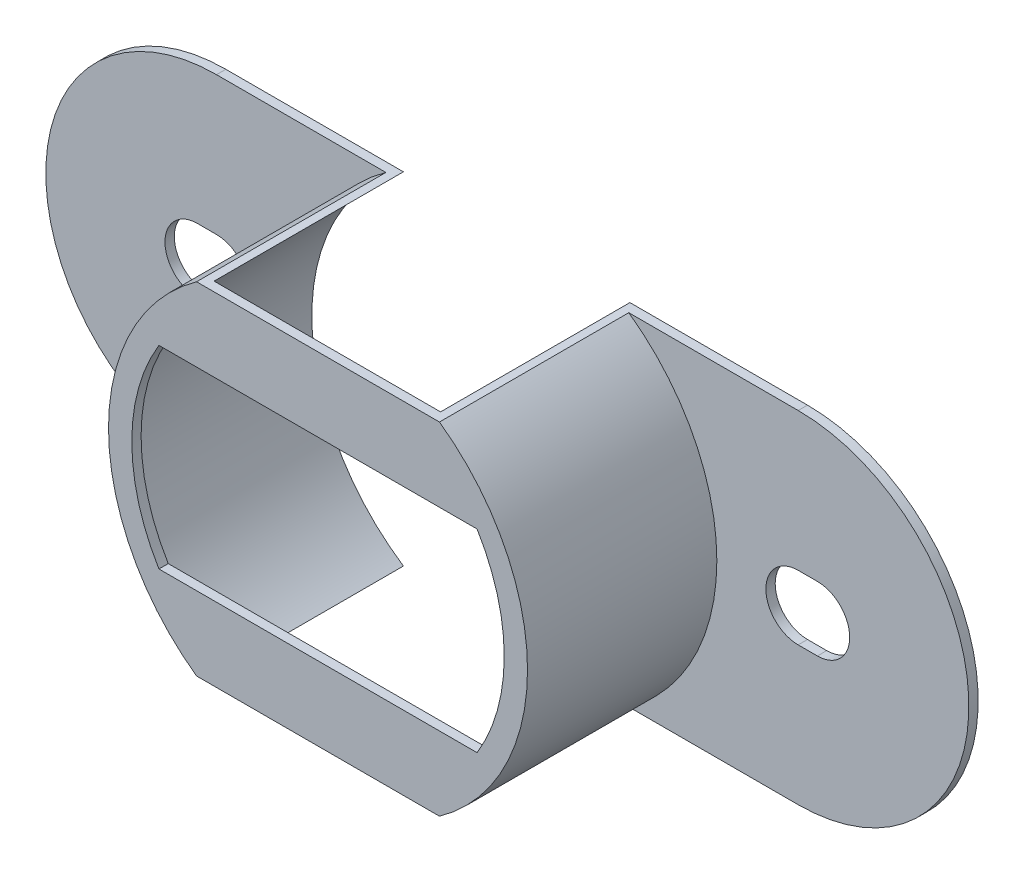
ISO-10303-21;
HEADER;
FILE_DESCRIPTION(('STEP AP214'),'2;1');
FILE_NAME('part.step','',(''),(''),'','','');
FILE_SCHEMA(('AUTOMOTIVE_DESIGN { 1 0 10303 214 1 1 1 1 }'));
ENDSEC;
DATA;
#1=APPLICATION_CONTEXT('core data for automotive mechanical design processes');
#2=APPLICATION_PROTOCOL_DEFINITION('international standard','automotive_design',2000,#1);
#3=PRODUCT_CONTEXT('',#1,'mechanical');
#4=PRODUCT('Part','Part','',(#3));
#5=PRODUCT_RELATED_PRODUCT_CATEGORY('part','',(#4));
#6=PRODUCT_DEFINITION_FORMATION('','',#4);
#7=PRODUCT_DEFINITION_CONTEXT('part definition',#1,'design');
#8=PRODUCT_DEFINITION('design','',#6,#7);
#9=PRODUCT_DEFINITION_SHAPE('','',#8);
#10=(LENGTH_UNIT() NAMED_UNIT(*) SI_UNIT(.MILLI.,.METRE.));
#11=(NAMED_UNIT(*) PLANE_ANGLE_UNIT() SI_UNIT($,.RADIAN.));
#12=(NAMED_UNIT(*) SI_UNIT($,.STERADIAN.) SOLID_ANGLE_UNIT());
#13=UNCERTAINTY_MEASURE_WITH_UNIT(LENGTH_MEASURE(1.E-05),#10,'distance_accuracy_value','');
#14=(GEOMETRIC_REPRESENTATION_CONTEXT(3) GLOBAL_UNCERTAINTY_ASSIGNED_CONTEXT((#13)) GLOBAL_UNIT_ASSIGNED_CONTEXT((#10,
#11,#12)) REPRESENTATION_CONTEXT('',''));
#15=CARTESIAN_POINT('',(0.,0.,0.));
#16=DIRECTION('',(0.,0.,1.));
#17=DIRECTION('',(1.,0.,0.));
#18=AXIS2_PLACEMENT_3D('',#15,#16,#17);
#19=CARTESIAN_POINT('',(-11.8999,0.,0.));
#20=DIRECTION('',(0.,0.,1.));
#21=DIRECTION('',(1.,0.,0.));
#22=AXIS2_PLACEMENT_3D('',#19,#20,#21);
#23=PLANE('',#22);
#24=CARTESIAN_POINT('',(12.6873,0.,0.));
#25=DIRECTION('',(0.,0.,1.));
#26=DIRECTION('',(1.,0.,0.));
#27=AXIS2_PLACEMENT_3D('',#24,#25,#26);
#28=CIRCLE('',#27,1.3208);
#29=CARTESIAN_POINT('',(12.6873,-1.3208,0.));
#30=VERTEX_POINT('',#29);
#31=CARTESIAN_POINT('',(12.6873,1.3208,0.));
#32=VERTEX_POINT('',#31);
#33=EDGE_CURVE('E357',#30,#32,#28,.T.);
#34=ORIENTED_EDGE('',*,*,#33,.T.);
#35=DIRECTION('',(-1.,0.,0.));
#36=VECTOR('',#35,1.);
#37=CARTESIAN_POINT('',(11.8999,1.3208,0.));
#38=LINE('',#37,#36);
#39=CARTESIAN_POINT('',(11.8999,1.3208,0.));
#40=VERTEX_POINT('',#39);
#41=EDGE_CURVE('E370',#32,#40,#38,.T.);
#42=ORIENTED_EDGE('',*,*,#41,.T.);
#43=CARTESIAN_POINT('',(11.8999,0.,0.));
#44=DIRECTION('',(0.,0.,1.));
#45=DIRECTION('',(1.,0.,0.));
#46=AXIS2_PLACEMENT_3D('',#43,#44,#45);
#47=CIRCLE('',#46,1.3208);
#48=CARTESIAN_POINT('',(11.8999,-1.3208,0.));
#49=VERTEX_POINT('',#48);
#50=EDGE_CURVE('E373',#40,#49,#47,.T.);
#51=ORIENTED_EDGE('',*,*,#50,.T.);
#52=DIRECTION('',(1.,0.,0.));
#53=VECTOR('',#52,1.);
#54=CARTESIAN_POINT('',(11.8999,-1.3208,0.));
#55=LINE('',#54,#53);
#56=EDGE_CURVE('E361',#49,#30,#55,.T.);
#57=ORIENTED_EDGE('',*,*,#56,.T.);
#58=EDGE_LOOP('',(#34,#42,#51,#57));
#59=FACE_BOUND('',#58,.T.);
#60=DIRECTION('',(1.,0.,0.));
#61=VECTOR('',#60,1.);
#62=CARTESIAN_POINT('',(-11.8999,-6.985,0.));
#63=LINE('',#62,#61);
#64=CARTESIAN_POINT('',(4.63332483212649,-6.985,0.));
#65=VERTEX_POINT('',#64);
#66=CARTESIAN_POINT('',(11.8999,-6.985,0.));
#67=VERTEX_POINT('',#66);
#68=EDGE_CURVE('E422',#65,#67,#63,.T.);
#69=ORIENTED_EDGE('',*,*,#68,.F.);
#70=CARTESIAN_POINT('',(0.,0.,0.));
#71=DIRECTION('',(0.,0.,-1.));
#72=DIRECTION('',(-1.,0.,0.));
#73=AXIS2_PLACEMENT_3D('',#70,#71,#72);
#74=CIRCLE('',#73,8.382);
#75=CARTESIAN_POINT('',(4.63332483212649,6.985,0.));
#76=VERTEX_POINT('',#75);
#77=EDGE_CURVE('E220',#76,#65,#74,.T.);
#78=ORIENTED_EDGE('',*,*,#77,.F.);
#79=DIRECTION('',(-1.,0.,0.));
#80=VECTOR('',#79,1.);
#81=CARTESIAN_POINT('',(-11.8999,6.985,0.));
#82=LINE('',#81,#80);
#83=CARTESIAN_POINT('',(11.8999,6.985,0.));
#84=VERTEX_POINT('',#83);
#85=EDGE_CURVE('E392',#84,#76,#82,.T.);
#86=ORIENTED_EDGE('',*,*,#85,.F.);
#87=CARTESIAN_POINT('',(11.8999,0.,0.));
#88=DIRECTION('',(0.,0.,1.));
#89=DIRECTION('',(1.,0.,0.));
#90=AXIS2_PLACEMENT_3D('',#87,#88,#89);
#91=CIRCLE('',#90,6.985);
#92=EDGE_CURVE('E417',#67,#84,#91,.T.);
#93=ORIENTED_EDGE('',*,*,#92,.F.);
#94=EDGE_LOOP('',(#69,#78,#86,#93));
#95=FACE_BOUND('',#94,.T.);
#96=ADVANCED_FACE('F34',(#59,#95),#23,.F.);
#97=CARTESIAN_POINT('',(-11.8999,0.,0.381));
#98=DIRECTION('',(0.,0.,1.));
#99=DIRECTION('',(1.,0.,0.));
#100=AXIS2_PLACEMENT_3D('',#97,#98,#99);
#101=PLANE('',#100);
#102=CARTESIAN_POINT('',(0.,0.,0.381));
#103=DIRECTION('',(0.,0.,1.));
#104=DIRECTION('',(1.,0.,0.));
#105=AXIS2_PLACEMENT_3D('',#102,#103,#104);
#106=CIRCLE('',#105,8.5725);
#107=CARTESIAN_POINT('',(-4.96966107999328,6.985,0.381));
#108=VERTEX_POINT('',#107);
#109=CARTESIAN_POINT('',(-4.96966107999328,-6.985,0.381));
#110=VERTEX_POINT('',#109);
#111=EDGE_CURVE('E240',#108,#110,#106,.T.);
#112=ORIENTED_EDGE('',*,*,#111,.F.);
#113=DIRECTION('',(-1.,0.,0.));
#114=VECTOR('',#113,1.);
#115=CARTESIAN_POINT('',(-11.8999,6.985,0.381));
#116=LINE('',#115,#114);
#117=CARTESIAN_POINT('',(-11.8999,6.985,0.381));
#118=VERTEX_POINT('',#117);
#119=EDGE_CURVE('E427',#108,#118,#116,.T.);
#120=ORIENTED_EDGE('',*,*,#119,.T.);
#121=CARTESIAN_POINT('',(-11.8999,0.,0.381));
#122=DIRECTION('',(0.,0.,1.));
#123=DIRECTION('',(1.,0.,0.));
#124=AXIS2_PLACEMENT_3D('',#121,#122,#123);
#125=CIRCLE('',#124,6.985);
#126=CARTESIAN_POINT('',(-11.8999,-6.985,0.381));
#127=VERTEX_POINT('',#126);
#128=EDGE_CURVE('E388',#118,#127,#125,.T.);
#129=ORIENTED_EDGE('',*,*,#128,.T.);
#130=DIRECTION('',(1.,0.,0.));
#131=VECTOR('',#130,1.);
#132=CARTESIAN_POINT('',(-11.8999,-6.985,0.381));
#133=LINE('',#132,#131);
#134=EDGE_CURVE('E401',#127,#110,#133,.T.);
#135=ORIENTED_EDGE('',*,*,#134,.T.);
#136=EDGE_LOOP('',(#112,#120,#129,#135));
#137=FACE_BOUND('',#136,.T.);
#138=DIRECTION('',(1.,0.,0.));
#139=VECTOR('',#138,1.);
#140=CARTESIAN_POINT('',(-12.6873,-1.3208,0.381));
#141=LINE('',#140,#139);
#142=CARTESIAN_POINT('',(-12.6873,-1.3208,0.381));
#143=VERTEX_POINT('',#142);
#144=CARTESIAN_POINT('',(-11.8999,-1.3208,0.381));
#145=VERTEX_POINT('',#144);
#146=EDGE_CURVE('E477',#143,#145,#141,.T.);
#147=ORIENTED_EDGE('',*,*,#146,.F.);
#148=CARTESIAN_POINT('',(-12.6873,0.,0.381));
#149=DIRECTION('',(0.,0.,1.));
#150=DIRECTION('',(1.,0.,0.));
#151=AXIS2_PLACEMENT_3D('',#148,#149,#150);
#152=CIRCLE('',#151,1.3208);
#153=CARTESIAN_POINT('',(-12.6873,1.3208,0.381));
#154=VERTEX_POINT('',#153);
#155=EDGE_CURVE('E348',#154,#143,#152,.T.);
#156=ORIENTED_EDGE('',*,*,#155,.F.);
#157=DIRECTION('',(-1.,0.,0.));
#158=VECTOR('',#157,1.);
#159=CARTESIAN_POINT('',(-12.6873,1.3208,0.381));
#160=LINE('',#159,#158);
#161=CARTESIAN_POINT('',(-11.8999,1.3208,0.381));
#162=VERTEX_POINT('',#161);
#163=EDGE_CURVE('E343',#162,#154,#160,.T.);
#164=ORIENTED_EDGE('',*,*,#163,.F.);
#165=CARTESIAN_POINT('',(-11.8999,0.,0.381));
#166=DIRECTION('',(0.,0.,1.));
#167=DIRECTION('',(1.,0.,0.));
#168=AXIS2_PLACEMENT_3D('',#165,#166,#167);
#169=CIRCLE('',#168,1.3208);
#170=EDGE_CURVE('E480',#145,#162,#169,.T.);
#171=ORIENTED_EDGE('',*,*,#170,.F.);
#172=EDGE_LOOP('',(#147,#156,#164,#171));
#173=FACE_BOUND('',#172,.T.);
#174=ADVANCED_FACE('F297',(#137,#173),#101,.T.);
#175=CARTESIAN_POINT('',(0.,0.,0.381));
#176=DIRECTION('',(0.,0.,1.));
#177=DIRECTION('',(1.,0.,0.));
#178=AXIS2_PLACEMENT_3D('',#175,#176,#177);
#179=CIRCLE('',#178,8.5725);
#180=CARTESIAN_POINT('',(4.96966107999329,-6.985,0.381));
#181=VERTEX_POINT('',#180);
#182=CARTESIAN_POINT('',(4.96966107999328,6.985,0.381));
#183=VERTEX_POINT('',#182);
#184=EDGE_CURVE('E252',#181,#183,#179,.T.);
#185=ORIENTED_EDGE('',*,*,#184,.F.);
#186=CARTESIAN_POINT('',(11.8999,-6.985,0.381));
#187=VERTEX_POINT('',#186);
#188=EDGE_CURVE('E391',#181,#187,#133,.T.);
#189=ORIENTED_EDGE('',*,*,#188,.T.);
#190=CARTESIAN_POINT('',(11.8999,0.,0.381));
#191=DIRECTION('',(0.,0.,1.));
#192=DIRECTION('',(1.,0.,0.));
#193=AXIS2_PLACEMENT_3D('',#190,#191,#192);
#194=CIRCLE('',#193,6.985);
#195=CARTESIAN_POINT('',(11.8999,6.985,0.381));
#196=VERTEX_POINT('',#195);
#197=EDGE_CURVE('E395',#187,#196,#194,.T.);
#198=ORIENTED_EDGE('',*,*,#197,.T.);
#199=EDGE_CURVE('E414',#196,#183,#116,.T.);
#200=ORIENTED_EDGE('',*,*,#199,.T.);
#201=EDGE_LOOP('',(#185,#189,#198,#200));
#202=FACE_BOUND('',#201,.T.);
#203=DIRECTION('',(-1.,0.,0.));
#204=VECTOR('',#203,1.);
#205=CARTESIAN_POINT('',(11.8999,1.3208,0.381));
#206=LINE('',#205,#204);
#207=CARTESIAN_POINT('',(12.6873,1.3208,0.381));
#208=VERTEX_POINT('',#207);
#209=CARTESIAN_POINT('',(11.8999,1.3208,0.381));
#210=VERTEX_POINT('',#209);
#211=EDGE_CURVE('E360',#208,#210,#206,.T.);
#212=ORIENTED_EDGE('',*,*,#211,.F.);
#213=CARTESIAN_POINT('',(12.6873,0.,0.381));
#214=DIRECTION('',(0.,0.,1.));
#215=DIRECTION('',(1.,0.,0.));
#216=AXIS2_PLACEMENT_3D('',#213,#214,#215);
#217=CIRCLE('',#216,1.3208);
#218=CARTESIAN_POINT('',(12.6873,-1.3208,0.381));
#219=VERTEX_POINT('',#218);
#220=EDGE_CURVE('E358',#219,#208,#217,.T.);
#221=ORIENTED_EDGE('',*,*,#220,.F.);
#222=DIRECTION('',(1.,0.,0.));
#223=VECTOR('',#222,1.);
#224=CARTESIAN_POINT('',(11.8999,-1.3208,0.381));
#225=LINE('',#224,#223);
#226=CARTESIAN_POINT('',(11.8999,-1.3208,0.381));
#227=VERTEX_POINT('',#226);
#228=EDGE_CURVE('E366',#227,#219,#225,.T.);
#229=ORIENTED_EDGE('',*,*,#228,.F.);
#230=CARTESIAN_POINT('',(11.8999,0.,0.381));
#231=DIRECTION('',(0.,0.,1.));
#232=DIRECTION('',(1.,0.,0.));
#233=AXIS2_PLACEMENT_3D('',#230,#231,#232);
#234=CIRCLE('',#233,1.3208);
#235=EDGE_CURVE('E363',#210,#227,#234,.T.);
#236=ORIENTED_EDGE('',*,*,#235,.F.);
#237=EDGE_LOOP('',(#212,#221,#229,#236));
#238=FACE_BOUND('',#237,.T.);
#239=ADVANCED_FACE('F304',(#202,#238),#101,.T.);
#240=CARTESIAN_POINT('',(-4.63332483212649,6.985,0.));
#241=VERTEX_POINT('',#240);
#242=CARTESIAN_POINT('',(-11.8999,6.985,0.));
#243=VERTEX_POINT('',#242);
#244=EDGE_CURVE('E323',#241,#243,#82,.T.);
#245=ORIENTED_EDGE('',*,*,#244,.F.);
#246=CARTESIAN_POINT('',(0.,0.,0.));
#247=DIRECTION('',(0.,0.,-1.));
#248=DIRECTION('',(-1.,0.,0.));
#249=AXIS2_PLACEMENT_3D('',#246,#247,#248);
#250=CIRCLE('',#249,8.382);
#251=CARTESIAN_POINT('',(-4.63332483212649,-6.985,0.));
#252=VERTEX_POINT('',#251);
#253=EDGE_CURVE('E227',#252,#241,#250,.T.);
#254=ORIENTED_EDGE('',*,*,#253,.F.);
#255=CARTESIAN_POINT('',(-11.8999,-6.985,0.));
#256=VERTEX_POINT('',#255);
#257=EDGE_CURVE('E419',#256,#252,#63,.T.);
#258=ORIENTED_EDGE('',*,*,#257,.F.);
#259=CARTESIAN_POINT('',(-11.8999,0.,0.));
#260=DIRECTION('',(0.,0.,1.));
#261=DIRECTION('',(1.,0.,0.));
#262=AXIS2_PLACEMENT_3D('',#259,#260,#261);
#263=CIRCLE('',#262,6.985);
#264=EDGE_CURVE('E387',#243,#256,#263,.T.);
#265=ORIENTED_EDGE('',*,*,#264,.F.);
#266=EDGE_LOOP('',(#245,#254,#258,#265));
#267=FACE_BOUND('',#266,.T.);
#268=CARTESIAN_POINT('',(-12.6873,0.,0.));
#269=DIRECTION('',(0.,0.,1.));
#270=DIRECTION('',(1.,0.,0.));
#271=AXIS2_PLACEMENT_3D('',#268,#269,#270);
#272=CIRCLE('',#271,1.3208);
#273=CARTESIAN_POINT('',(-12.6873,1.3208,0.));
#274=VERTEX_POINT('',#273);
#275=CARTESIAN_POINT('',(-12.6873,-1.3208,0.));
#276=VERTEX_POINT('',#275);
#277=EDGE_CURVE('E327',#274,#276,#272,.T.);
#278=ORIENTED_EDGE('',*,*,#277,.T.);
#279=DIRECTION('',(1.,0.,0.));
#280=VECTOR('',#279,1.);
#281=CARTESIAN_POINT('',(-12.6873,-1.3208,0.));
#282=LINE('',#281,#280);
#283=CARTESIAN_POINT('',(-11.8999,-1.3208,0.));
#284=VERTEX_POINT('',#283);
#285=EDGE_CURVE('E329',#276,#284,#282,.T.);
#286=ORIENTED_EDGE('',*,*,#285,.T.);
#287=CARTESIAN_POINT('',(-11.8999,0.,0.));
#288=DIRECTION('',(0.,0.,1.));
#289=DIRECTION('',(1.,0.,0.));
#290=AXIS2_PLACEMENT_3D('',#287,#288,#289);
#291=CIRCLE('',#290,1.3208);
#292=CARTESIAN_POINT('',(-11.8999,1.3208,0.));
#293=VERTEX_POINT('',#292);
#294=EDGE_CURVE('E338',#284,#293,#291,.T.);
#295=ORIENTED_EDGE('',*,*,#294,.T.);
#296=DIRECTION('',(-1.,0.,0.));
#297=VECTOR('',#296,1.);
#298=CARTESIAN_POINT('',(-12.6873,1.3208,0.));
#299=LINE('',#298,#297);
#300=EDGE_CURVE('E331',#293,#274,#299,.T.);
#301=ORIENTED_EDGE('',*,*,#300,.T.);
#302=EDGE_LOOP('',(#278,#286,#295,#301));
#303=FACE_BOUND('',#302,.T.);
#304=ADVANCED_FACE('F300',(#267,#303),#23,.F.);
#305=CARTESIAN_POINT('',(-11.8999,0.,0.381));
#306=DIRECTION('',(0.,0.,-1.));
#307=DIRECTION('',(-1.,0.,0.));
#308=AXIS2_PLACEMENT_3D('',#305,#306,#307);
#309=CYLINDRICAL_SURFACE('',#308,6.985);
#310=ORIENTED_EDGE('',*,*,#264,.T.);
#311=DIRECTION('',(0.,0.,-1.));
#312=VECTOR('',#311,1.);
#313=CARTESIAN_POINT('',(-11.8999,-6.985,0.381));
#314=LINE('',#313,#312);
#315=EDGE_CURVE('E276',#127,#256,#314,.T.);
#316=ORIENTED_EDGE('',*,*,#315,.F.);
#317=ORIENTED_EDGE('',*,*,#128,.F.);
#318=DIRECTION('',(0.,0.,-1.));
#319=VECTOR('',#318,1.);
#320=CARTESIAN_POINT('',(-11.8999,6.985,0.381));
#321=LINE('',#320,#319);
#322=EDGE_CURVE('E411',#118,#243,#321,.T.);
#323=ORIENTED_EDGE('',*,*,#322,.T.);
#324=EDGE_LOOP('',(#310,#316,#317,#323));
#325=FACE_BOUND('',#324,.T.);
#326=ADVANCED_FACE('F36',(#325),#309,.T.);
#327=CARTESIAN_POINT('',(-11.8999,-6.985,0.381));
#328=DIRECTION('',(0.,1.,0.));
#329=DIRECTION('',(-1.,0.,0.));
#330=AXIS2_PLACEMENT_3D('',#327,#328,#329);
#331=PLANE('',#330);
#332=DIRECTION('',(-1.,0.,0.));
#333=VECTOR('',#332,1.);
#334=CARTESIAN_POINT('',(4.63332483212649,-6.985,7.747));
#335=LINE('',#334,#333);
#336=CARTESIAN_POINT('',(4.63332483212649,-6.985,7.747));
#337=VERTEX_POINT('',#336);
#338=CARTESIAN_POINT('',(-4.63332483212649,-6.985,7.747));
#339=VERTEX_POINT('',#338);
#340=EDGE_CURVE('E226',#337,#339,#335,.T.);
#341=ORIENTED_EDGE('',*,*,#340,.F.);
#342=DIRECTION('',(0.,0.,-1.));
#343=VECTOR('',#342,1.);
#344=CARTESIAN_POINT('',(4.63332483212649,-6.985,7.747));
#345=LINE('',#344,#343);
#346=EDGE_CURVE('E235',#337,#65,#345,.T.);
#347=ORIENTED_EDGE('',*,*,#346,.T.);
#348=ORIENTED_EDGE('',*,*,#68,.T.);
#349=DIRECTION('',(0.,0.,-1.));
#350=VECTOR('',#349,1.);
#351=CARTESIAN_POINT('',(11.8999,-6.985,0.381));
#352=LINE('',#351,#350);
#353=EDGE_CURVE('E405',#187,#67,#352,.T.);
#354=ORIENTED_EDGE('',*,*,#353,.F.);
#355=ORIENTED_EDGE('',*,*,#188,.F.);
#356=DIRECTION('',(0.,0.,-1.));
#357=VECTOR('',#356,1.);
#358=CARTESIAN_POINT('',(4.96966107999328,-6.985,8.128));
#359=LINE('',#358,#357);
#360=CARTESIAN_POINT('',(4.96966107999328,-6.985,8.128));
#361=VERTEX_POINT('',#360);
#362=EDGE_CURVE('E341',#361,#181,#359,.T.);
#363=ORIENTED_EDGE('',*,*,#362,.F.);
#364=DIRECTION('',(1.,0.,0.));
#365=VECTOR('',#364,1.);
#366=CARTESIAN_POINT('',(-4.96966107999328,-6.985,8.128));
#367=LINE('',#366,#365);
#368=CARTESIAN_POINT('',(-4.96966107999328,-6.985,8.128));
#369=VERTEX_POINT('',#368);
#370=EDGE_CURVE('E251',#369,#361,#367,.T.);
#371=ORIENTED_EDGE('',*,*,#370,.F.);
#372=DIRECTION('',(0.,0.,-1.));
#373=VECTOR('',#372,1.);
#374=CARTESIAN_POINT('',(-4.96966107999328,-6.985,8.128));
#375=LINE('',#374,#373);
#376=EDGE_CURVE('E336',#369,#110,#375,.T.);
#377=ORIENTED_EDGE('',*,*,#376,.T.);
#378=ORIENTED_EDGE('',*,*,#134,.F.);
#379=ORIENTED_EDGE('',*,*,#315,.T.);
#380=ORIENTED_EDGE('',*,*,#257,.T.);
#381=DIRECTION('',(0.,0.,-1.));
#382=VECTOR('',#381,1.);
#383=CARTESIAN_POINT('',(-4.63332483212649,-6.985,7.747));
#384=LINE('',#383,#382);
#385=EDGE_CURVE('E244',#339,#252,#384,.T.);
#386=ORIENTED_EDGE('',*,*,#385,.F.);
#387=EDGE_LOOP('',(#341,#347,#348,#354,#355,#363,#371,#377,#378,#379,#380,#386));
#388=FACE_BOUND('',#387,.T.);
#389=ADVANCED_FACE('F316',(#388),#331,.F.);
#390=CARTESIAN_POINT('',(11.8999,0.,0.381));
#391=DIRECTION('',(0.,0.,-1.));
#392=DIRECTION('',(-1.,0.,0.));
#393=AXIS2_PLACEMENT_3D('',#390,#391,#392);
#394=CYLINDRICAL_SURFACE('',#393,6.985);
#395=ORIENTED_EDGE('',*,*,#92,.T.);
#396=DIRECTION('',(0.,0.,-1.));
#397=VECTOR('',#396,1.);
#398=CARTESIAN_POINT('',(11.8999,6.985,0.381));
#399=LINE('',#398,#397);
#400=EDGE_CURVE('E408',#196,#84,#399,.T.);
#401=ORIENTED_EDGE('',*,*,#400,.F.);
#402=ORIENTED_EDGE('',*,*,#197,.F.);
#403=ORIENTED_EDGE('',*,*,#353,.T.);
#404=EDGE_LOOP('',(#395,#401,#402,#403));
#405=FACE_BOUND('',#404,.T.);
#406=ADVANCED_FACE('F439',(#405),#394,.T.);
#407=CARTESIAN_POINT('',(-11.8999,6.985,0.381));
#408=DIRECTION('',(0.,-1.,0.));
#409=DIRECTION('',(1.,0.,0.));
#410=AXIS2_PLACEMENT_3D('',#407,#408,#409);
#411=PLANE('',#410);
#412=ORIENTED_EDGE('',*,*,#85,.T.);
#413=DIRECTION('',(0.,0.,-1.));
#414=VECTOR('',#413,1.);
#415=CARTESIAN_POINT('',(4.63332483212649,6.985,7.747));
#416=LINE('',#415,#414);
#417=CARTESIAN_POINT('',(4.63332483212649,6.985,7.747));
#418=VERTEX_POINT('',#417);
#419=EDGE_CURVE('E238',#418,#76,#416,.T.);
#420=ORIENTED_EDGE('',*,*,#419,.F.);
#421=DIRECTION('',(1.,0.,0.));
#422=VECTOR('',#421,1.);
#423=CARTESIAN_POINT('',(4.63332483212649,6.985,7.747));
#424=LINE('',#423,#422);
#425=CARTESIAN_POINT('',(-4.63332483212649,6.985,7.747));
#426=VERTEX_POINT('',#425);
#427=EDGE_CURVE('E232',#426,#418,#424,.T.);
#428=ORIENTED_EDGE('',*,*,#427,.F.);
#429=DIRECTION('',(0.,0.,-1.));
#430=VECTOR('',#429,1.);
#431=CARTESIAN_POINT('',(-4.63332483212649,6.985,7.747));
#432=LINE('',#431,#430);
#433=EDGE_CURVE('E241',#426,#241,#432,.T.);
#434=ORIENTED_EDGE('',*,*,#433,.T.);
#435=ORIENTED_EDGE('',*,*,#244,.T.);
#436=ORIENTED_EDGE('',*,*,#322,.F.);
#437=ORIENTED_EDGE('',*,*,#119,.F.);
#438=DIRECTION('',(0.,0.,-1.));
#439=VECTOR('',#438,1.);
#440=CARTESIAN_POINT('',(-4.96966107999328,6.985,8.128));
#441=LINE('',#440,#439);
#442=CARTESIAN_POINT('',(-4.96966107999328,6.985,8.128));
#443=VERTEX_POINT('',#442);
#444=EDGE_CURVE('E258',#443,#108,#441,.T.);
#445=ORIENTED_EDGE('',*,*,#444,.F.);
#446=DIRECTION('',(-1.,0.,0.));
#447=VECTOR('',#446,1.);
#448=CARTESIAN_POINT('',(-4.96966107999328,6.985,8.128));
#449=LINE('',#448,#447);
#450=CARTESIAN_POINT('',(4.96966107999328,6.985,8.128));
#451=VERTEX_POINT('',#450);
#452=EDGE_CURVE('E256',#451,#443,#449,.T.);
#453=ORIENTED_EDGE('',*,*,#452,.F.);
#454=DIRECTION('',(0.,0.,-1.));
#455=VECTOR('',#454,1.);
#456=CARTESIAN_POINT('',(4.96966107999328,6.985,8.128));
#457=LINE('',#456,#455);
#458=EDGE_CURVE('E271',#451,#183,#457,.T.);
#459=ORIENTED_EDGE('',*,*,#458,.T.);
#460=ORIENTED_EDGE('',*,*,#199,.F.);
#461=ORIENTED_EDGE('',*,*,#400,.T.);
#462=EDGE_LOOP('',(#412,#420,#428,#434,#435,#436,#437,#445,#453,#459,#460,#461));
#463=FACE_BOUND('',#462,.T.);
#464=ADVANCED_FACE('F444',(#463),#411,.F.);
#465=CARTESIAN_POINT('',(12.6873,0.,0.381));
#466=DIRECTION('',(0.,0.,-1.));
#467=DIRECTION('',(-1.,0.,0.));
#468=AXIS2_PLACEMENT_3D('',#465,#466,#467);
#469=CYLINDRICAL_SURFACE('',#468,1.3208);
#470=ORIENTED_EDGE('',*,*,#33,.F.);
#471=DIRECTION('',(0.,0.,-1.));
#472=VECTOR('',#471,1.);
#473=CARTESIAN_POINT('',(12.6873,-1.3208,0.381));
#474=LINE('',#473,#472);
#475=EDGE_CURVE('E368',#219,#30,#474,.T.);
#476=ORIENTED_EDGE('',*,*,#475,.F.);
#477=ORIENTED_EDGE('',*,*,#220,.T.);
#478=DIRECTION('',(0.,0.,-1.));
#479=VECTOR('',#478,1.);
#480=CARTESIAN_POINT('',(12.6873,1.3208,0.381));
#481=LINE('',#480,#479);
#482=EDGE_CURVE('E384',#208,#32,#481,.T.);
#483=ORIENTED_EDGE('',*,*,#482,.T.);
#484=EDGE_LOOP('',(#470,#476,#477,#483));
#485=FACE_BOUND('',#484,.T.);
#486=ADVANCED_FACE('F519',(#485),#469,.F.);
#487=CARTESIAN_POINT('',(11.8999,1.3208,0.381));
#488=DIRECTION('',(0.,-1.,0.));
#489=DIRECTION('',(0.,0.,-1.));
#490=AXIS2_PLACEMENT_3D('',#487,#488,#489);
#491=PLANE('',#490);
#492=ORIENTED_EDGE('',*,*,#41,.F.);
#493=ORIENTED_EDGE('',*,*,#482,.F.);
#494=ORIENTED_EDGE('',*,*,#211,.T.);
#495=DIRECTION('',(0.,0.,-1.));
#496=VECTOR('',#495,1.);
#497=CARTESIAN_POINT('',(11.8999,1.3208,0.381));
#498=LINE('',#497,#496);
#499=EDGE_CURVE('E382',#210,#40,#498,.T.);
#500=ORIENTED_EDGE('',*,*,#499,.T.);
#501=EDGE_LOOP('',(#492,#493,#494,#500));
#502=FACE_BOUND('',#501,.T.);
#503=ADVANCED_FACE('F515',(#502),#491,.T.);
#504=CARTESIAN_POINT('',(11.8999,0.,0.381));
#505=DIRECTION('',(0.,0.,-1.));
#506=DIRECTION('',(-1.,0.,0.));
#507=AXIS2_PLACEMENT_3D('',#504,#505,#506);
#508=CYLINDRICAL_SURFACE('',#507,1.3208);
#509=ORIENTED_EDGE('',*,*,#50,.F.);
#510=ORIENTED_EDGE('',*,*,#499,.F.);
#511=ORIENTED_EDGE('',*,*,#235,.T.);
#512=DIRECTION('',(0.,0.,-1.));
#513=VECTOR('',#512,1.);
#514=CARTESIAN_POINT('',(11.8999,-1.3208,0.381));
#515=LINE('',#514,#513);
#516=EDGE_CURVE('E380',#227,#49,#515,.T.);
#517=ORIENTED_EDGE('',*,*,#516,.T.);
#518=EDGE_LOOP('',(#509,#510,#511,#517));
#519=FACE_BOUND('',#518,.T.);
#520=ADVANCED_FACE('F511',(#519),#508,.F.);
#521=CARTESIAN_POINT('',(11.8999,-1.3208,0.381));
#522=DIRECTION('',(0.,1.,0.));
#523=DIRECTION('',(0.,0.,1.));
#524=AXIS2_PLACEMENT_3D('',#521,#522,#523);
#525=PLANE('',#524);
#526=ORIENTED_EDGE('',*,*,#56,.F.);
#527=ORIENTED_EDGE('',*,*,#516,.F.);
#528=ORIENTED_EDGE('',*,*,#228,.T.);
#529=ORIENTED_EDGE('',*,*,#475,.T.);
#530=EDGE_LOOP('',(#526,#527,#528,#529));
#531=FACE_BOUND('',#530,.T.);
#532=ADVANCED_FACE('F508',(#531),#525,.T.);
#533=CARTESIAN_POINT('',(-12.6873,0.,0.381));
#534=DIRECTION('',(0.,0.,-1.));
#535=DIRECTION('',(-1.,0.,0.));
#536=AXIS2_PLACEMENT_3D('',#533,#534,#535);
#537=CYLINDRICAL_SURFACE('',#536,1.3208);
#538=ORIENTED_EDGE('',*,*,#277,.F.);
#539=DIRECTION('',(0.,0.,-1.));
#540=VECTOR('',#539,1.);
#541=CARTESIAN_POINT('',(-12.6873,1.3208,0.381));
#542=LINE('',#541,#540);
#543=EDGE_CURVE('E349',#154,#274,#542,.T.);
#544=ORIENTED_EDGE('',*,*,#543,.F.);
#545=ORIENTED_EDGE('',*,*,#155,.T.);
#546=DIRECTION('',(0.,0.,-1.));
#547=VECTOR('',#546,1.);
#548=CARTESIAN_POINT('',(-12.6873,-1.3208,0.381));
#549=LINE('',#548,#547);
#550=EDGE_CURVE('E355',#143,#276,#549,.T.);
#551=ORIENTED_EDGE('',*,*,#550,.T.);
#552=EDGE_LOOP('',(#538,#544,#545,#551));
#553=FACE_BOUND('',#552,.T.);
#554=ADVANCED_FACE('F485',(#553),#537,.F.);
#555=CARTESIAN_POINT('',(-12.6873,-1.3208,0.381));
#556=DIRECTION('',(0.,1.,0.));
#557=DIRECTION('',(0.,0.,1.));
#558=AXIS2_PLACEMENT_3D('',#555,#556,#557);
#559=PLANE('',#558);
#560=ORIENTED_EDGE('',*,*,#285,.F.);
#561=ORIENTED_EDGE('',*,*,#550,.F.);
#562=ORIENTED_EDGE('',*,*,#146,.T.);
#563=DIRECTION('',(0.,0.,-1.));
#564=VECTOR('',#563,1.);
#565=CARTESIAN_POINT('',(-11.8999,-1.3208,0.381));
#566=LINE('',#565,#564);
#567=EDGE_CURVE('E353',#145,#284,#566,.T.);
#568=ORIENTED_EDGE('',*,*,#567,.T.);
#569=EDGE_LOOP('',(#560,#561,#562,#568));
#570=FACE_BOUND('',#569,.T.);
#571=ADVANCED_FACE('F486',(#570),#559,.T.);
#572=CARTESIAN_POINT('',(-11.8999,0.,0.381));
#573=DIRECTION('',(0.,0.,-1.));
#574=DIRECTION('',(-1.,0.,0.));
#575=AXIS2_PLACEMENT_3D('',#572,#573,#574);
#576=CYLINDRICAL_SURFACE('',#575,1.3208);
#577=ORIENTED_EDGE('',*,*,#294,.F.);
#578=ORIENTED_EDGE('',*,*,#567,.F.);
#579=ORIENTED_EDGE('',*,*,#170,.T.);
#580=DIRECTION('',(0.,0.,-1.));
#581=VECTOR('',#580,1.);
#582=CARTESIAN_POINT('',(-11.8999,1.3208,0.381));
#583=LINE('',#582,#581);
#584=EDGE_CURVE('E351',#162,#293,#583,.T.);
#585=ORIENTED_EDGE('',*,*,#584,.T.);
#586=EDGE_LOOP('',(#577,#578,#579,#585));
#587=FACE_BOUND('',#586,.T.);
#588=ADVANCED_FACE('F489',(#587),#576,.F.);
#589=CARTESIAN_POINT('',(-12.6873,1.3208,0.381));
#590=DIRECTION('',(0.,-1.,0.));
#591=DIRECTION('',(0.,0.,-1.));
#592=AXIS2_PLACEMENT_3D('',#589,#590,#591);
#593=PLANE('',#592);
#594=ORIENTED_EDGE('',*,*,#300,.F.);
#595=ORIENTED_EDGE('',*,*,#584,.F.);
#596=ORIENTED_EDGE('',*,*,#163,.T.);
#597=ORIENTED_EDGE('',*,*,#543,.T.);
#598=EDGE_LOOP('',(#594,#595,#596,#597));
#599=FACE_BOUND('',#598,.T.);
#600=ADVANCED_FACE('F491',(#599),#593,.T.);
#601=CARTESIAN_POINT('',(0.,0.,8.128));
#602=DIRECTION('',(0.,0.,-1.));
#603=DIRECTION('',(-1.,0.,0.));
#604=AXIS2_PLACEMENT_3D('',#601,#602,#603);
#605=CYLINDRICAL_SURFACE('',#604,8.5725);
#606=ORIENTED_EDGE('',*,*,#111,.T.);
#607=ORIENTED_EDGE('',*,*,#376,.F.);
#608=CARTESIAN_POINT('',(0.,0.,8.128));
#609=DIRECTION('',(0.,0.,1.));
#610=DIRECTION('',(1.,0.,0.));
#611=AXIS2_PLACEMENT_3D('',#608,#609,#610);
#612=CIRCLE('',#611,8.5725);
#613=EDGE_CURVE('E248',#443,#369,#612,.T.);
#614=ORIENTED_EDGE('',*,*,#613,.F.);
#615=ORIENTED_EDGE('',*,*,#444,.T.);
#616=EDGE_LOOP('',(#606,#607,#614,#615));
#617=FACE_BOUND('',#616,.T.);
#618=ADVANCED_FACE('F493',(#617),#605,.T.);
#619=CARTESIAN_POINT('',(0.,0.,8.128));
#620=DIRECTION('',(0.,0.,-1.));
#621=DIRECTION('',(-1.,0.,0.));
#622=AXIS2_PLACEMENT_3D('',#619,#620,#621);
#623=CYLINDRICAL_SURFACE('',#622,8.5725);
#624=ORIENTED_EDGE('',*,*,#184,.T.);
#625=ORIENTED_EDGE('',*,*,#458,.F.);
#626=CARTESIAN_POINT('',(0.,0.,8.128));
#627=DIRECTION('',(0.,0.,1.));
#628=DIRECTION('',(1.,0.,0.));
#629=AXIS2_PLACEMENT_3D('',#626,#627,#628);
#630=CIRCLE('',#629,8.5725);
#631=EDGE_CURVE('E254',#361,#451,#630,.T.);
#632=ORIENTED_EDGE('',*,*,#631,.F.);
#633=ORIENTED_EDGE('',*,*,#362,.T.);
#634=EDGE_LOOP('',(#624,#625,#632,#633));
#635=FACE_BOUND('',#634,.T.);
#636=ADVANCED_FACE('F457',(#635),#623,.T.);
#637=CARTESIAN_POINT('',(0.,0.,8.128));
#638=DIRECTION('',(0.,0.,1.));
#639=DIRECTION('',(1.,0.,0.));
#640=AXIS2_PLACEMENT_3D('',#637,#638,#639);
#641=PLANE('',#640);
#642=CARTESIAN_POINT('',(0.,0.,8.128));
#643=DIRECTION('',(0.,0.,1.));
#644=DIRECTION('',(1.,0.,0.));
#645=AXIS2_PLACEMENT_3D('',#642,#643,#644);
#646=CIRCLE('',#645,7.62);
#647=CARTESIAN_POINT('',(-6.50874690243829,3.9624,8.128));
#648=VERTEX_POINT('',#647);
#649=CARTESIAN_POINT('',(-6.50874690243829,-3.9624,8.128));
#650=VERTEX_POINT('',#649);
#651=EDGE_CURVE('E49',#648,#650,#646,.T.);
#652=ORIENTED_EDGE('',*,*,#651,.F.);
#653=DIRECTION('',(-1.,0.,0.));
#654=VECTOR('',#653,1.);
#655=CARTESIAN_POINT('',(-6.50874690243829,3.9624,8.128));
#656=LINE('',#655,#654);
#657=CARTESIAN_POINT('',(6.50874690243829,3.9624,8.128));
#658=VERTEX_POINT('',#657);
#659=EDGE_CURVE('E213',#658,#648,#656,.T.);
#660=ORIENTED_EDGE('',*,*,#659,.F.);
#661=CARTESIAN_POINT('',(0.,0.,8.128));
#662=DIRECTION('',(0.,0.,1.));
#663=DIRECTION('',(1.,0.,0.));
#664=AXIS2_PLACEMENT_3D('',#661,#662,#663);
#665=CIRCLE('',#664,7.62);
#666=CARTESIAN_POINT('',(6.50874690243829,-3.9624,8.128));
#667=VERTEX_POINT('',#666);
#668=EDGE_CURVE('E197',#667,#658,#665,.T.);
#669=ORIENTED_EDGE('',*,*,#668,.F.);
#670=DIRECTION('',(1.,0.,0.));
#671=VECTOR('',#670,1.);
#672=CARTESIAN_POINT('',(-6.50874690243829,-3.9624,8.128));
#673=LINE('',#672,#671);
#674=EDGE_CURVE('E206',#650,#667,#673,.T.);
#675=ORIENTED_EDGE('',*,*,#674,.F.);
#676=EDGE_LOOP('',(#652,#660,#669,#675));
#677=FACE_BOUND('',#676,.T.);
#678=ORIENTED_EDGE('',*,*,#613,.T.);
#679=ORIENTED_EDGE('',*,*,#370,.T.);
#680=ORIENTED_EDGE('',*,*,#631,.T.);
#681=ORIENTED_EDGE('',*,*,#452,.T.);
#682=EDGE_LOOP('',(#678,#679,#680,#681));
#683=FACE_BOUND('',#682,.T.);
#684=ADVANCED_FACE('F210',(#677,#683),#641,.T.);
#685=CARTESIAN_POINT('',(0.,0.,7.747));
#686=DIRECTION('',(0.,0.,-1.));
#687=DIRECTION('',(-1.,0.,0.));
#688=AXIS2_PLACEMENT_3D('',#685,#686,#687);
#689=CYLINDRICAL_SURFACE('',#688,8.382);
#690=ORIENTED_EDGE('',*,*,#77,.T.);
#691=ORIENTED_EDGE('',*,*,#346,.F.);
#692=CARTESIAN_POINT('',(0.,0.,7.747));
#693=DIRECTION('',(0.,0.,-1.));
#694=DIRECTION('',(-1.,0.,0.));
#695=AXIS2_PLACEMENT_3D('',#692,#693,#694);
#696=CIRCLE('',#695,8.382);
#697=EDGE_CURVE('E223',#418,#337,#696,.T.);
#698=ORIENTED_EDGE('',*,*,#697,.F.);
#699=ORIENTED_EDGE('',*,*,#419,.T.);
#700=EDGE_LOOP('',(#690,#691,#698,#699));
#701=FACE_BOUND('',#700,.T.);
#702=ADVANCED_FACE('F466',(#701),#689,.F.);
#703=CARTESIAN_POINT('',(0.,0.,7.747));
#704=DIRECTION('',(0.,0.,-1.));
#705=DIRECTION('',(-1.,0.,0.));
#706=AXIS2_PLACEMENT_3D('',#703,#704,#705);
#707=CYLINDRICAL_SURFACE('',#706,8.382);
#708=ORIENTED_EDGE('',*,*,#253,.T.);
#709=ORIENTED_EDGE('',*,*,#433,.F.);
#710=CARTESIAN_POINT('',(0.,0.,7.747));
#711=DIRECTION('',(0.,0.,-1.));
#712=DIRECTION('',(-1.,0.,0.));
#713=AXIS2_PLACEMENT_3D('',#710,#711,#712);
#714=CIRCLE('',#713,8.382);
#715=EDGE_CURVE('E230',#339,#426,#714,.T.);
#716=ORIENTED_EDGE('',*,*,#715,.F.);
#717=ORIENTED_EDGE('',*,*,#385,.T.);
#718=EDGE_LOOP('',(#708,#709,#716,#717));
#719=FACE_BOUND('',#718,.T.);
#720=ADVANCED_FACE('F293',(#719),#707,.F.);
#721=CARTESIAN_POINT('',(0.,0.,7.747));
#722=DIRECTION('',(0.,0.,-1.));
#723=DIRECTION('',(-1.,0.,0.));
#724=AXIS2_PLACEMENT_3D('',#721,#722,#723);
#725=PLANE('',#724);
#726=CARTESIAN_POINT('',(0.,0.,7.747));
#727=DIRECTION('',(0.,0.,-1.));
#728=DIRECTION('',(-1.,0.,0.));
#729=AXIS2_PLACEMENT_3D('',#726,#727,#728);
#730=CIRCLE('',#729,7.62);
#731=CARTESIAN_POINT('',(-6.50874690243829,-3.9624,7.747));
#732=VERTEX_POINT('',#731);
#733=CARTESIAN_POINT('',(-6.50874690243829,3.9624,7.747));
#734=VERTEX_POINT('',#733);
#735=EDGE_CURVE('E11',#732,#734,#730,.T.);
#736=ORIENTED_EDGE('',*,*,#735,.F.);
#737=DIRECTION('',(-1.,0.,0.));
#738=VECTOR('',#737,1.);
#739=CARTESIAN_POINT('',(0.,-3.9624,7.747));
#740=LINE('',#739,#738);
#741=CARTESIAN_POINT('',(6.50874690243829,-3.9624,7.747));
#742=VERTEX_POINT('',#741);
#743=EDGE_CURVE('E274',#742,#732,#740,.T.);
#744=ORIENTED_EDGE('',*,*,#743,.F.);
#745=CARTESIAN_POINT('',(0.,0.,7.747));
#746=DIRECTION('',(0.,0.,-1.));
#747=DIRECTION('',(-1.,0.,0.));
#748=AXIS2_PLACEMENT_3D('',#745,#746,#747);
#749=CIRCLE('',#748,7.62);
#750=CARTESIAN_POINT('',(6.50874690243829,3.9624,7.747));
#751=VERTEX_POINT('',#750);
#752=EDGE_CURVE('E200',#751,#742,#749,.T.);
#753=ORIENTED_EDGE('',*,*,#752,.F.);
#754=DIRECTION('',(1.,0.,0.));
#755=VECTOR('',#754,1.);
#756=CARTESIAN_POINT('',(0.,3.9624,7.747));
#757=LINE('',#756,#755);
#758=EDGE_CURVE('E42',#734,#751,#757,.T.);
#759=ORIENTED_EDGE('',*,*,#758,.F.);
#760=EDGE_LOOP('',(#736,#744,#753,#759));
#761=FACE_BOUND('',#760,.T.);
#762=ORIENTED_EDGE('',*,*,#697,.T.);
#763=ORIENTED_EDGE('',*,*,#340,.T.);
#764=ORIENTED_EDGE('',*,*,#715,.T.);
#765=ORIENTED_EDGE('',*,*,#427,.T.);
#766=EDGE_LOOP('',(#762,#763,#764,#765));
#767=FACE_BOUND('',#766,.T.);
#768=ADVANCED_FACE('F283',(#761,#767),#725,.T.);
#769=CARTESIAN_POINT('',(0.,0.,0.));
#770=DIRECTION('',(0.,0.,1.));
#771=DIRECTION('',(1.,0.,0.));
#772=AXIS2_PLACEMENT_3D('',#769,#770,#771);
#773=CYLINDRICAL_SURFACE('',#772,7.62);
#774=ORIENTED_EDGE('',*,*,#735,.T.);
#775=DIRECTION('',(0.,0.,1.));
#776=VECTOR('',#775,1.);
#777=CARTESIAN_POINT('',(-6.50874690243829,3.9624,0.));
#778=LINE('',#777,#776);
#779=EDGE_CURVE('E218',#734,#648,#778,.T.);
#780=ORIENTED_EDGE('',*,*,#779,.T.);
#781=ORIENTED_EDGE('',*,*,#651,.T.);
#782=DIRECTION('',(0.,0.,1.));
#783=VECTOR('',#782,1.);
#784=CARTESIAN_POINT('',(-6.50874690243829,-3.9624,0.));
#785=LINE('',#784,#783);
#786=EDGE_CURVE('E203',#732,#650,#785,.T.);
#787=ORIENTED_EDGE('',*,*,#786,.F.);
#788=EDGE_LOOP('',(#774,#780,#781,#787));
#789=FACE_BOUND('',#788,.T.);
#790=ADVANCED_FACE('F285',(#789),#773,.F.);
#791=CARTESIAN_POINT('',(-6.50874690243829,3.9624,0.));
#792=DIRECTION('',(0.,1.,0.));
#793=DIRECTION('',(0.,0.,1.));
#794=AXIS2_PLACEMENT_3D('',#791,#792,#793);
#795=PLANE('',#794);
#796=ORIENTED_EDGE('',*,*,#758,.T.);
#797=DIRECTION('',(0.,0.,1.));
#798=VECTOR('',#797,1.);
#799=CARTESIAN_POINT('',(6.50874690243829,3.9624,0.));
#800=LINE('',#799,#798);
#801=EDGE_CURVE('E202',#751,#658,#800,.T.);
#802=ORIENTED_EDGE('',*,*,#801,.T.);
#803=ORIENTED_EDGE('',*,*,#659,.T.);
#804=ORIENTED_EDGE('',*,*,#779,.F.);
#805=EDGE_LOOP('',(#796,#802,#803,#804));
#806=FACE_BOUND('',#805,.T.);
#807=ADVANCED_FACE('F280',(#806),#795,.F.);
#808=CARTESIAN_POINT('',(0.,0.,0.));
#809=DIRECTION('',(0.,0.,1.));
#810=DIRECTION('',(1.,0.,0.));
#811=AXIS2_PLACEMENT_3D('',#808,#809,#810);
#812=CYLINDRICAL_SURFACE('',#811,7.62);
#813=ORIENTED_EDGE('',*,*,#752,.T.);
#814=DIRECTION('',(0.,0.,1.));
#815=VECTOR('',#814,1.);
#816=CARTESIAN_POINT('',(6.50874690243829,-3.9624,0.));
#817=LINE('',#816,#815);
#818=EDGE_CURVE('E57',#742,#667,#817,.T.);
#819=ORIENTED_EDGE('',*,*,#818,.T.);
#820=ORIENTED_EDGE('',*,*,#668,.T.);
#821=ORIENTED_EDGE('',*,*,#801,.F.);
#822=EDGE_LOOP('',(#813,#819,#820,#821));
#823=FACE_BOUND('',#822,.T.);
#824=ADVANCED_FACE('F194',(#823),#812,.F.);
#825=CARTESIAN_POINT('',(-6.50874690243829,-3.9624,0.));
#826=DIRECTION('',(0.,-1.,0.));
#827=DIRECTION('',(0.,0.,-1.));
#828=AXIS2_PLACEMENT_3D('',#825,#826,#827);
#829=PLANE('',#828);
#830=ORIENTED_EDGE('',*,*,#743,.T.);
#831=ORIENTED_EDGE('',*,*,#786,.T.);
#832=ORIENTED_EDGE('',*,*,#674,.T.);
#833=ORIENTED_EDGE('',*,*,#818,.F.);
#834=EDGE_LOOP('',(#830,#831,#832,#833));
#835=FACE_BOUND('',#834,.T.);
#836=ADVANCED_FACE('F207',(#835),#829,.F.);
#837=CLOSED_SHELL('',(#96,#174,#239,#304,#326,#389,#406,#464,#486,#503,#520,#532,#554,#571,#588,
#600,#618,#636,#684,#702,#720,#768,#790,#807,#824,#836));
#838=MANIFOLD_SOLID_BREP('B2',#837);
#839=ADVANCED_BREP_SHAPE_REPRESENTATION('',(#18,#838),#14);
#840=SHAPE_DEFINITION_REPRESENTATION(#9,#839);
ENDSEC;
END-ISO-10303-21;
